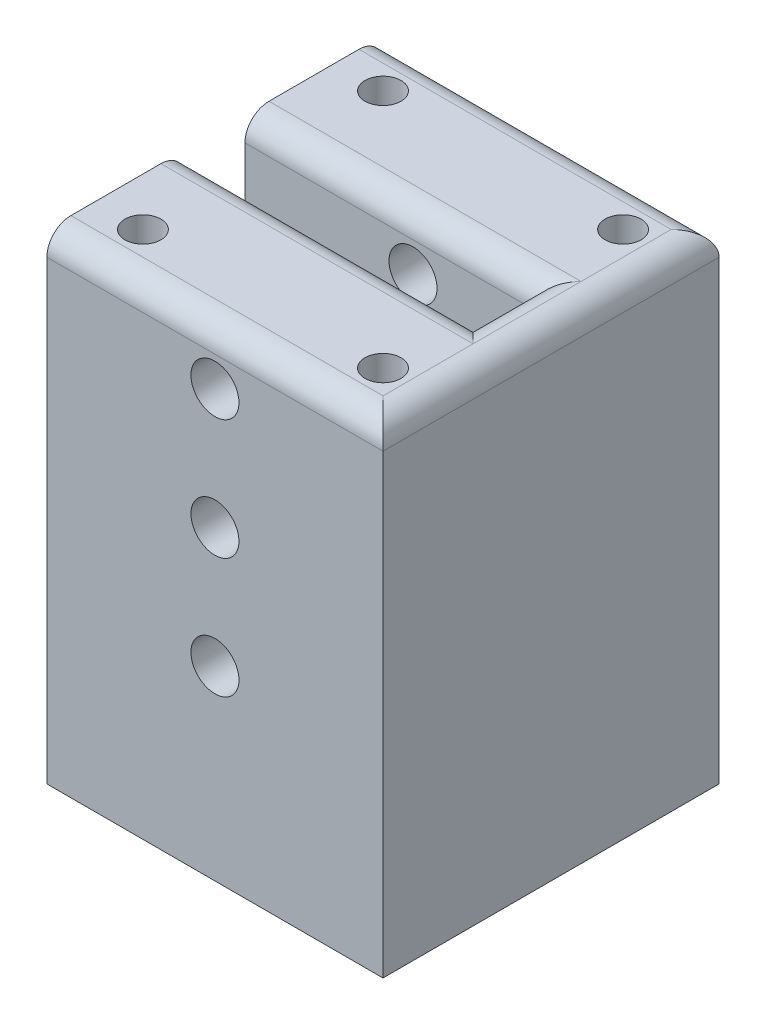
ISO-10303-21;
HEADER;
FILE_DESCRIPTION(('STEP AP214'),'2;1');
FILE_NAME('part.step','',(''),(''),'','','');
FILE_SCHEMA(('AUTOMOTIVE_DESIGN { 1 0 10303 214 1 1 1 1 }'));
ENDSEC;
DATA;
#1=APPLICATION_CONTEXT('core data for automotive mechanical design processes');
#2=APPLICATION_PROTOCOL_DEFINITION('international standard','automotive_design',2000,#1);
#3=PRODUCT_CONTEXT('',#1,'mechanical');
#4=PRODUCT('Part','Part','',(#3));
#5=PRODUCT_RELATED_PRODUCT_CATEGORY('part','',(#4));
#6=PRODUCT_DEFINITION_FORMATION('','',#4);
#7=PRODUCT_DEFINITION_CONTEXT('part definition',#1,'design');
#8=PRODUCT_DEFINITION('design','',#6,#7);
#9=PRODUCT_DEFINITION_SHAPE('','',#8);
#10=(LENGTH_UNIT() NAMED_UNIT(*) SI_UNIT(.MILLI.,.METRE.));
#11=(NAMED_UNIT(*) PLANE_ANGLE_UNIT() SI_UNIT($,.RADIAN.));
#12=(NAMED_UNIT(*) SI_UNIT($,.STERADIAN.) SOLID_ANGLE_UNIT());
#13=UNCERTAINTY_MEASURE_WITH_UNIT(LENGTH_MEASURE(1.E-05),#10,'distance_accuracy_value','');
#14=(GEOMETRIC_REPRESENTATION_CONTEXT(3) GLOBAL_UNCERTAINTY_ASSIGNED_CONTEXT((#13)) GLOBAL_UNIT_ASSIGNED_CONTEXT((#10,
#11,#12)) REPRESENTATION_CONTEXT('',''));
#15=CARTESIAN_POINT('',(0.,0.,0.));
#16=DIRECTION('',(0.,0.,1.));
#17=DIRECTION('',(1.,0.,0.));
#18=AXIS2_PLACEMENT_3D('',#15,#16,#17);
#19=CARTESIAN_POINT('',(0.,40.,0.));
#20=DIRECTION('',(0.,1.,0.));
#21=DIRECTION('',(0.,0.,1.));
#22=AXIS2_PLACEMENT_3D('',#19,#20,#21);
#23=PLANE('',#22);
#24=DIRECTION('',(0.,0.,1.));
#25=VECTOR('',#24,1.);
#26=CARTESIAN_POINT('',(-24.2432407118146,40.,-13.9976530264726));
#27=LINE('',#26,#25);
#28=CARTESIAN_POINT('',(-24.2432407118146,40.,-11.9976530264726));
#29=VERTEX_POINT('',#28);
#30=CARTESIAN_POINT('',(-24.2432407118146,40.,-4.49765302647256));
#31=VERTEX_POINT('',#30);
#32=EDGE_CURVE('E182',#29,#31,#27,.T.);
#33=ORIENTED_EDGE('',*,*,#32,.T.);
#34=DIRECTION('',(-1.,0.,0.));
#35=VECTOR('',#34,1.);
#36=CARTESIAN_POINT('',(-0.243240711814627,40.,-4.49765302647257));
#37=LINE('',#36,#35);
#38=CARTESIAN_POINT('',(1.75675928818537,40.,-4.49765302647256));
#39=VERTEX_POINT('',#38);
#40=EDGE_CURVE('E230',#31,#39,#37,.F.);
#41=ORIENTED_EDGE('',*,*,#40,.T.);
#42=DIRECTION('',(0.,0.,-1.));
#43=VECTOR('',#42,1.);
#44=CARTESIAN_POINT('',(1.75675928818537,40.,-13.9976530264726));
#45=LINE('',#44,#43);
#46=CARTESIAN_POINT('',(1.75675928818537,40.,-11.9976530264726));
#47=VERTEX_POINT('',#46);
#48=EDGE_CURVE('E226',#39,#47,#45,.T.);
#49=ORIENTED_EDGE('',*,*,#48,.T.);
#50=DIRECTION('',(-1.,0.,0.));
#51=VECTOR('',#50,1.);
#52=CARTESIAN_POINT('',(-24.2432407118146,40.,-11.9976530264726));
#53=LINE('',#52,#51);
#54=EDGE_CURVE('E228',#47,#29,#53,.T.);
#55=ORIENTED_EDGE('',*,*,#54,.T.);
#56=EDGE_LOOP('',(#33,#41,#49,#55));
#57=FACE_BOUND('',#56,.T.);
#58=CARTESIAN_POINT('',(-0.243240711814631,40.,-9.99765302647257));
#59=DIRECTION('',(0.,1.,0.));
#60=DIRECTION('',(0.,0.,1.));
#61=AXIS2_PLACEMENT_3D('',#58,#59,#60);
#62=CIRCLE('',#61,1.5);
#63=CARTESIAN_POINT('',(-0.243240711814631,40.,-8.49765302647257));
#64=VERTEX_POINT('',#63);
#65=EDGE_CURVE('E170',#64,#64,#62,.T.);
#66=ORIENTED_EDGE('',*,*,#65,.F.);
#67=EDGE_LOOP('',(#66));
#68=FACE_BOUND('',#67,.T.);
#69=CARTESIAN_POINT('',(-20.2432407118146,40.,-9.99765302647257));
#70=DIRECTION('',(0.,1.,0.));
#71=DIRECTION('',(0.,0.,1.));
#72=AXIS2_PLACEMENT_3D('',#69,#70,#71);
#73=CIRCLE('',#72,1.5);
#74=CARTESIAN_POINT('',(-20.2432407118146,40.,-8.49765302647256));
#75=VERTEX_POINT('',#74);
#76=EDGE_CURVE('E176',#75,#75,#73,.T.);
#77=ORIENTED_EDGE('',*,*,#76,.F.);
#78=EDGE_LOOP('',(#77));
#79=FACE_BOUND('',#78,.T.);
#80=ADVANCED_FACE('F33',(#57,#68,#79),#23,.T.);
#81=DIRECTION('',(0.,0.,-1.));
#82=VECTOR('',#81,1.);
#83=CARTESIAN_POINT('',(1.75675928818537,40.,-13.9976530264726));
#84=LINE('',#83,#82);
#85=CARTESIAN_POINT('',(1.75675928818537,40.,12.0023469735274));
#86=VERTEX_POINT('',#85);
#87=CARTESIAN_POINT('',(1.75675928818537,40.,4.50234697352743));
#88=VERTEX_POINT('',#87);
#89=EDGE_CURVE('E222',#86,#88,#84,.T.);
#90=ORIENTED_EDGE('',*,*,#89,.T.);
#91=DIRECTION('',(1.,0.,0.));
#92=VECTOR('',#91,1.);
#93=CARTESIAN_POINT('',(-24.2432407118146,40.,4.50234697352743));
#94=LINE('',#93,#92);
#95=CARTESIAN_POINT('',(-24.2432407118146,40.,4.50234697352743));
#96=VERTEX_POINT('',#95);
#97=EDGE_CURVE('E224',#88,#96,#94,.F.);
#98=ORIENTED_EDGE('',*,*,#97,.T.);
#99=CARTESIAN_POINT('',(-24.2432407118146,40.,12.0023469735274));
#100=VERTEX_POINT('',#99);
#101=EDGE_CURVE('E186',#96,#100,#27,.T.);
#102=ORIENTED_EDGE('',*,*,#101,.T.);
#103=DIRECTION('',(1.,0.,0.));
#104=VECTOR('',#103,1.);
#105=CARTESIAN_POINT('',(3.75675928818537,40.,12.0023469735274));
#106=LINE('',#105,#104);
#107=EDGE_CURVE('E220',#100,#86,#106,.T.);
#108=ORIENTED_EDGE('',*,*,#107,.T.);
#109=EDGE_LOOP('',(#90,#98,#102,#108));
#110=FACE_BOUND('',#109,.T.);
#111=CARTESIAN_POINT('',(-20.2432407118146,40.,10.0023469735274));
#112=DIRECTION('',(0.,1.,0.));
#113=DIRECTION('',(0.,0.,1.));
#114=AXIS2_PLACEMENT_3D('',#111,#112,#113);
#115=CIRCLE('',#114,1.5);
#116=CARTESIAN_POINT('',(-20.2432407118146,40.,11.5023469735274));
#117=VERTEX_POINT('',#116);
#118=EDGE_CURVE('E164',#117,#117,#115,.T.);
#119=ORIENTED_EDGE('',*,*,#118,.F.);
#120=EDGE_LOOP('',(#119));
#121=FACE_BOUND('',#120,.T.);
#122=CARTESIAN_POINT('',(-0.243240711814628,40.,10.0023469735274));
#123=DIRECTION('',(0.,1.,0.));
#124=DIRECTION('',(0.,0.,1.));
#125=AXIS2_PLACEMENT_3D('',#122,#123,#124);
#126=CIRCLE('',#125,1.5);
#127=CARTESIAN_POINT('',(-0.243240711814628,40.,11.5023469735274));
#128=VERTEX_POINT('',#127);
#129=EDGE_CURVE('E156',#128,#128,#126,.T.);
#130=ORIENTED_EDGE('',*,*,#129,.F.);
#131=EDGE_LOOP('',(#130));
#132=FACE_BOUND('',#131,.T.);
#133=ADVANCED_FACE('F326',(#110,#121,#132),#23,.T.);
#134=CARTESIAN_POINT('',(0.,0.,0.));
#135=DIRECTION('',(0.,1.,0.));
#136=DIRECTION('',(0.,0.,1.));
#137=AXIS2_PLACEMENT_3D('',#134,#135,#136);
#138=PLANE('',#137);
#139=DIRECTION('',(0.,0.,1.));
#140=VECTOR('',#139,1.);
#141=CARTESIAN_POINT('',(-24.2432407118146,0.,-13.9976530264726));
#142=LINE('',#141,#140);
#143=CARTESIAN_POINT('',(-24.2432407118146,0.,-13.9976530264726));
#144=VERTEX_POINT('',#143);
#145=CARTESIAN_POINT('',(-24.2432407118146,0.,14.0023469735274));
#146=VERTEX_POINT('',#145);
#147=EDGE_CURVE('E179',#144,#146,#142,.T.);
#148=ORIENTED_EDGE('',*,*,#147,.F.);
#149=DIRECTION('',(-1.,0.,0.));
#150=VECTOR('',#149,1.);
#151=CARTESIAN_POINT('',(-24.2432407118146,0.,-13.9976530264726));
#152=LINE('',#151,#150);
#153=CARTESIAN_POINT('',(3.75675928818537,0.,-13.9976530264726));
#154=VERTEX_POINT('',#153);
#155=EDGE_CURVE('E195',#154,#144,#152,.T.);
#156=ORIENTED_EDGE('',*,*,#155,.F.);
#157=DIRECTION('',(0.,0.,-1.));
#158=VECTOR('',#157,1.);
#159=CARTESIAN_POINT('',(3.75675928818537,0.,-13.9976530264726));
#160=LINE('',#159,#158);
#161=CARTESIAN_POINT('',(3.75675928818537,0.,14.0023469735274));
#162=VERTEX_POINT('',#161);
#163=EDGE_CURVE('E192',#162,#154,#160,.T.);
#164=ORIENTED_EDGE('',*,*,#163,.F.);
#165=DIRECTION('',(1.,0.,0.));
#166=VECTOR('',#165,1.);
#167=CARTESIAN_POINT('',(-24.2432407118146,0.,14.0023469735274));
#168=LINE('',#167,#166);
#169=EDGE_CURVE('E189',#146,#162,#168,.T.);
#170=ORIENTED_EDGE('',*,*,#169,.F.);
#171=EDGE_LOOP('',(#148,#156,#164,#170));
#172=FACE_BOUND('',#171,.T.);
#173=CARTESIAN_POINT('',(-20.2432407118146,0.,-9.99765302647257));
#174=DIRECTION('',(0.,1.,0.));
#175=DIRECTION('',(0.,0.,1.));
#176=AXIS2_PLACEMENT_3D('',#173,#174,#175);
#177=CIRCLE('',#176,1.5);
#178=CARTESIAN_POINT('',(-20.2432407118146,0.,-8.49765302647256));
#179=VERTEX_POINT('',#178);
#180=EDGE_CURVE('E173',#179,#179,#177,.T.);
#181=ORIENTED_EDGE('',*,*,#180,.T.);
#182=EDGE_LOOP('',(#181));
#183=FACE_BOUND('',#182,.T.);
#184=CARTESIAN_POINT('',(-0.243240711814631,0.,-9.99765302647257));
#185=DIRECTION('',(0.,1.,0.));
#186=DIRECTION('',(0.,0.,1.));
#187=AXIS2_PLACEMENT_3D('',#184,#185,#186);
#188=CIRCLE('',#187,1.5);
#189=CARTESIAN_POINT('',(-0.243240711814631,0.,-8.49765302647257));
#190=VERTEX_POINT('',#189);
#191=EDGE_CURVE('E167',#190,#190,#188,.T.);
#192=ORIENTED_EDGE('',*,*,#191,.T.);
#193=EDGE_LOOP('',(#192));
#194=FACE_BOUND('',#193,.T.);
#195=CARTESIAN_POINT('',(-20.2432407118146,0.,10.0023469735274));
#196=DIRECTION('',(0.,1.,0.));
#197=DIRECTION('',(0.,0.,1.));
#198=AXIS2_PLACEMENT_3D('',#195,#196,#197);
#199=CIRCLE('',#198,1.5);
#200=CARTESIAN_POINT('',(-20.2432407118146,0.,11.5023469735274));
#201=VERTEX_POINT('',#200);
#202=EDGE_CURVE('E159',#201,#201,#199,.T.);
#203=ORIENTED_EDGE('',*,*,#202,.T.);
#204=EDGE_LOOP('',(#203));
#205=FACE_BOUND('',#204,.T.);
#206=CARTESIAN_POINT('',(-0.243240711814628,0.,10.0023469735274));
#207=DIRECTION('',(0.,1.,0.));
#208=DIRECTION('',(0.,0.,1.));
#209=AXIS2_PLACEMENT_3D('',#206,#207,#208);
#210=CIRCLE('',#209,1.5);
#211=CARTESIAN_POINT('',(-0.243240711814628,0.,11.5023469735274));
#212=VERTEX_POINT('',#211);
#213=EDGE_CURVE('E160',#212,#212,#210,.T.);
#214=ORIENTED_EDGE('',*,*,#213,.T.);
#215=EDGE_LOOP('',(#214));
#216=FACE_BOUND('',#215,.T.);
#217=ADVANCED_FACE('F315',(#172,#183,#194,#205,#216),#138,.F.);
#218=CARTESIAN_POINT('',(-24.2432407118146,40.,-13.9976530264726));
#219=DIRECTION('',(1.,0.,0.));
#220=DIRECTION('',(0.,0.,-1.));
#221=AXIS2_PLACEMENT_3D('',#218,#219,#220);
#222=PLANE('',#221);
#223=ORIENTED_EDGE('',*,*,#101,.F.);
#224=CARTESIAN_POINT('',(-24.2432407118146,38.,4.50234697352743));
#225=DIRECTION('',(1.,0.,0.));
#226=DIRECTION('',(0.,0.,-1.));
#227=AXIS2_PLACEMENT_3D('',#224,#225,#226);
#228=CIRCLE('',#227,2.);
#229=CARTESIAN_POINT('',(-24.2432407118146,38.,2.50234697352743));
#230=VERTEX_POINT('',#229);
#231=EDGE_CURVE('E149',#96,#230,#228,.F.);
#232=ORIENTED_EDGE('',*,*,#231,.T.);
#233=DIRECTION('',(0.,1.,0.));
#234=VECTOR('',#233,1.);
#235=CARTESIAN_POINT('',(-24.2432407118146,10.,2.50234697352743));
#236=LINE('',#235,#234);
#237=CARTESIAN_POINT('',(-24.2432407118146,10.,2.50234697352743));
#238=VERTEX_POINT('',#237);
#239=EDGE_CURVE('E127',#238,#230,#236,.T.);
#240=ORIENTED_EDGE('',*,*,#239,.F.);
#241=DIRECTION('',(0.,0.,1.));
#242=VECTOR('',#241,1.);
#243=CARTESIAN_POINT('',(-24.2432407118146,10.,-2.49765302647257));
#244=LINE('',#243,#242);
#245=CARTESIAN_POINT('',(-24.2432407118146,10.,-2.49765302647257));
#246=VERTEX_POINT('',#245);
#247=EDGE_CURVE('E135',#246,#238,#244,.T.);
#248=ORIENTED_EDGE('',*,*,#247,.F.);
#249=DIRECTION('',(0.,1.,0.));
#250=VECTOR('',#249,1.);
#251=CARTESIAN_POINT('',(-24.2432407118146,10.,-2.49765302647257));
#252=LINE('',#251,#250);
#253=CARTESIAN_POINT('',(-24.2432407118146,38.,-2.49765302647257));
#254=VERTEX_POINT('',#253);
#255=EDGE_CURVE('E163',#246,#254,#252,.T.);
#256=ORIENTED_EDGE('',*,*,#255,.T.);
#257=CARTESIAN_POINT('',(-24.2432407118146,38.,-4.49765302647257));
#258=DIRECTION('',(1.,0.,0.));
#259=DIRECTION('',(0.,0.,-1.));
#260=AXIS2_PLACEMENT_3D('',#257,#258,#259);
#261=CIRCLE('',#260,2.);
#262=EDGE_CURVE('E236',#254,#31,#261,.F.);
#263=ORIENTED_EDGE('',*,*,#262,.T.);
#264=ORIENTED_EDGE('',*,*,#32,.F.);
#265=CARTESIAN_POINT('',(-24.2432407118146,38.,-11.9976530264726));
#266=DIRECTION('',(1.,0.,0.));
#267=DIRECTION('',(0.,0.,-1.));
#268=AXIS2_PLACEMENT_3D('',#265,#266,#267);
#269=CIRCLE('',#268,2.);
#270=CARTESIAN_POINT('',(-24.2432407118146,38.,-13.9976530264726));
#271=VERTEX_POINT('',#270);
#272=EDGE_CURVE('E234',#29,#271,#269,.F.);
#273=ORIENTED_EDGE('',*,*,#272,.T.);
#274=DIRECTION('',(0.,-1.,0.));
#275=VECTOR('',#274,1.);
#276=CARTESIAN_POINT('',(-24.2432407118146,40.,-13.9976530264726));
#277=LINE('',#276,#275);
#278=EDGE_CURVE('E185',#271,#144,#277,.T.);
#279=ORIENTED_EDGE('',*,*,#278,.T.);
#280=ORIENTED_EDGE('',*,*,#147,.T.);
#281=DIRECTION('',(0.,-1.,0.));
#282=VECTOR('',#281,1.);
#283=CARTESIAN_POINT('',(-24.2432407118146,40.,14.0023469735274));
#284=LINE('',#283,#282);
#285=CARTESIAN_POINT('',(-24.2432407118146,38.,14.0023469735274));
#286=VERTEX_POINT('',#285);
#287=EDGE_CURVE('E203',#286,#146,#284,.T.);
#288=ORIENTED_EDGE('',*,*,#287,.F.);
#289=CARTESIAN_POINT('',(-24.2432407118146,38.,12.0023469735274));
#290=DIRECTION('',(1.,0.,0.));
#291=DIRECTION('',(0.,0.,-1.));
#292=AXIS2_PLACEMENT_3D('',#289,#290,#291);
#293=CIRCLE('',#292,2.);
#294=EDGE_CURVE('E232',#286,#100,#293,.F.);
#295=ORIENTED_EDGE('',*,*,#294,.T.);
#296=EDGE_LOOP('',(#223,#232,#240,#248,#256,#263,#264,#273,#279,#280,#288,#295));
#297=FACE_BOUND('',#296,.T.);
#298=ADVANCED_FACE('F147',(#297),#222,.F.);
#299=CARTESIAN_POINT('',(-24.2432407118146,40.,14.0023469735274));
#300=DIRECTION('',(0.,0.,-1.));
#301=DIRECTION('',(-1.,0.,0.));
#302=AXIS2_PLACEMENT_3D('',#299,#300,#301);
#303=PLANE('',#302);
#304=CARTESIAN_POINT('',(-10.2432407118146,35.5,14.0023469735274));
#305=DIRECTION('',(0.,0.,1.));
#306=DIRECTION('',(1.,0.,0.));
#307=AXIS2_PLACEMENT_3D('',#304,#305,#306);
#308=CIRCLE('',#307,1.99999999999999);
#309=CARTESIAN_POINT('',(-8.24324071181463,35.5,14.0023469735274));
#310=VERTEX_POINT('',#309);
#311=EDGE_CURVE('E256',#310,#310,#308,.T.);
#312=ORIENTED_EDGE('',*,*,#311,.F.);
#313=EDGE_LOOP('',(#312));
#314=FACE_BOUND('',#313,.T.);
#315=CARTESIAN_POINT('',(-10.2432407118146,25.5,14.0023469735274));
#316=DIRECTION('',(0.,0.,1.));
#317=DIRECTION('',(1.,0.,0.));
#318=AXIS2_PLACEMENT_3D('',#315,#316,#317);
#319=CIRCLE('',#318,1.99999999999999);
#320=CARTESIAN_POINT('',(-8.24324071181463,25.5,14.0023469735274));
#321=VERTEX_POINT('',#320);
#322=EDGE_CURVE('E268',#321,#321,#319,.T.);
#323=ORIENTED_EDGE('',*,*,#322,.F.);
#324=EDGE_LOOP('',(#323));
#325=FACE_BOUND('',#324,.T.);
#326=CARTESIAN_POINT('',(-10.2432407118146,15.5,14.0023469735274));
#327=DIRECTION('',(0.,0.,1.));
#328=DIRECTION('',(1.,0.,0.));
#329=AXIS2_PLACEMENT_3D('',#326,#327,#328);
#330=CIRCLE('',#329,1.99999999999999);
#331=CARTESIAN_POINT('',(-8.24324071181463,15.5,14.0023469735274));
#332=VERTEX_POINT('',#331);
#333=EDGE_CURVE('E275',#332,#332,#330,.T.);
#334=ORIENTED_EDGE('',*,*,#333,.F.);
#335=EDGE_LOOP('',(#334));
#336=FACE_BOUND('',#335,.T.);
#337=DIRECTION('',(0.,-1.,0.));
#338=VECTOR('',#337,1.);
#339=CARTESIAN_POINT('',(3.75675928818537,40.,14.0023469735274));
#340=LINE('',#339,#338);
#341=CARTESIAN_POINT('',(3.75675928818537,38.,14.0023469735274));
#342=VERTEX_POINT('',#341);
#343=EDGE_CURVE('E201',#342,#162,#340,.T.);
#344=ORIENTED_EDGE('',*,*,#343,.F.);
#345=DIRECTION('',(1.,0.,0.));
#346=VECTOR('',#345,1.);
#347=CARTESIAN_POINT('',(-24.2432407118146,38.,14.0023469735274));
#348=LINE('',#347,#346);
#349=EDGE_CURVE('E11',#342,#286,#348,.F.);
#350=ORIENTED_EDGE('',*,*,#349,.T.);
#351=ORIENTED_EDGE('',*,*,#287,.T.);
#352=ORIENTED_EDGE('',*,*,#169,.T.);
#353=EDGE_LOOP('',(#344,#350,#351,#352));
#354=FACE_BOUND('',#353,.T.);
#355=ADVANCED_FACE('F356',(#314,#325,#336,#354),#303,.F.);
#356=CARTESIAN_POINT('',(3.75675928818537,40.,-13.9976530264726));
#357=DIRECTION('',(-1.,0.,0.));
#358=DIRECTION('',(0.,0.,1.));
#359=AXIS2_PLACEMENT_3D('',#356,#357,#358);
#360=PLANE('',#359);
#361=DIRECTION('',(0.,-1.,0.));
#362=VECTOR('',#361,1.);
#363=CARTESIAN_POINT('',(3.75675928818537,40.,-13.9976530264726));
#364=LINE('',#363,#362);
#365=CARTESIAN_POINT('',(3.75675928818537,38.,-13.9976530264726));
#366=VERTEX_POINT('',#365);
#367=EDGE_CURVE('E199',#366,#154,#364,.T.);
#368=ORIENTED_EDGE('',*,*,#367,.F.);
#369=DIRECTION('',(0.,0.,-1.));
#370=VECTOR('',#369,1.);
#371=CARTESIAN_POINT('',(3.75675928818537,38.,14.0023469735274));
#372=LINE('',#371,#370);
#373=EDGE_CURVE('E42',#366,#342,#372,.F.);
#374=ORIENTED_EDGE('',*,*,#373,.T.);
#375=ORIENTED_EDGE('',*,*,#343,.T.);
#376=ORIENTED_EDGE('',*,*,#163,.T.);
#377=EDGE_LOOP('',(#368,#374,#375,#376));
#378=FACE_BOUND('',#377,.T.);
#379=ADVANCED_FACE('F352',(#378),#360,.F.);
#380=CARTESIAN_POINT('',(-24.2432407118146,40.,-13.9976530264726));
#381=DIRECTION('',(0.,0.,1.));
#382=DIRECTION('',(1.,0.,0.));
#383=AXIS2_PLACEMENT_3D('',#380,#381,#382);
#384=PLANE('',#383);
#385=CARTESIAN_POINT('',(-10.2432407118146,35.5,-13.9976530264726));
#386=DIRECTION('',(0.,0.,1.));
#387=DIRECTION('',(1.,0.,0.));
#388=AXIS2_PLACEMENT_3D('',#385,#386,#387);
#389=CIRCLE('',#388,1.99999999999999);
#390=CARTESIAN_POINT('',(-8.24324071181463,35.5,-13.9976530264726));
#391=VERTEX_POINT('',#390);
#392=EDGE_CURVE('E215',#391,#391,#389,.T.);
#393=ORIENTED_EDGE('',*,*,#392,.T.);
#394=EDGE_LOOP('',(#393));
#395=FACE_BOUND('',#394,.T.);
#396=CARTESIAN_POINT('',(-10.2432407118146,25.5,-13.9976530264726));
#397=DIRECTION('',(0.,0.,1.));
#398=DIRECTION('',(1.,0.,0.));
#399=AXIS2_PLACEMENT_3D('',#396,#397,#398);
#400=CIRCLE('',#399,1.99999999999999);
#401=CARTESIAN_POINT('',(-8.24324071181463,25.5,-13.9976530264726));
#402=VERTEX_POINT('',#401);
#403=EDGE_CURVE('E210',#402,#402,#400,.T.);
#404=ORIENTED_EDGE('',*,*,#403,.T.);
#405=EDGE_LOOP('',(#404));
#406=FACE_BOUND('',#405,.T.);
#407=CARTESIAN_POINT('',(-10.2432407118146,15.5,-13.9976530264726));
#408=DIRECTION('',(0.,0.,1.));
#409=DIRECTION('',(1.,0.,0.));
#410=AXIS2_PLACEMENT_3D('',#407,#408,#409);
#411=CIRCLE('',#410,1.99999999999999);
#412=CARTESIAN_POINT('',(-8.24324071181463,15.5,-13.9976530264726));
#413=VERTEX_POINT('',#412);
#414=EDGE_CURVE('E278',#413,#413,#411,.T.);
#415=ORIENTED_EDGE('',*,*,#414,.T.);
#416=EDGE_LOOP('',(#415));
#417=FACE_BOUND('',#416,.T.);
#418=ORIENTED_EDGE('',*,*,#278,.F.);
#419=DIRECTION('',(-1.,0.,0.));
#420=VECTOR('',#419,1.);
#421=CARTESIAN_POINT('',(3.75675928818537,38.,-13.9976530264726));
#422=LINE('',#421,#420);
#423=EDGE_CURVE('E57',#271,#366,#422,.F.);
#424=ORIENTED_EDGE('',*,*,#423,.T.);
#425=ORIENTED_EDGE('',*,*,#367,.T.);
#426=ORIENTED_EDGE('',*,*,#155,.T.);
#427=EDGE_LOOP('',(#418,#424,#425,#426));
#428=FACE_BOUND('',#427,.T.);
#429=ADVANCED_FACE('F309',(#395,#406,#417,#428),#384,.F.);
#430=CARTESIAN_POINT('',(-20.2432407118146,40.,-9.99765302647257));
#431=DIRECTION('',(0.,-1.,0.));
#432=DIRECTION('',(0.,0.,-1.));
#433=AXIS2_PLACEMENT_3D('',#430,#431,#432);
#434=CYLINDRICAL_SURFACE('',#433,1.5);
#435=ORIENTED_EDGE('',*,*,#76,.T.);
#436=EDGE_LOOP('',(#435));
#437=FACE_BOUND('',#436,.T.);
#438=ORIENTED_EDGE('',*,*,#180,.F.);
#439=EDGE_LOOP('',(#438));
#440=FACE_BOUND('',#439,.T.);
#441=ADVANCED_FACE('F346',(#437,#440),#434,.F.);
#442=CARTESIAN_POINT('',(-0.243240711814631,40.,-9.99765302647257));
#443=DIRECTION('',(0.,-1.,0.));
#444=DIRECTION('',(0.,0.,-1.));
#445=AXIS2_PLACEMENT_3D('',#442,#443,#444);
#446=CYLINDRICAL_SURFACE('',#445,1.5);
#447=ORIENTED_EDGE('',*,*,#65,.T.);
#448=EDGE_LOOP('',(#447));
#449=FACE_BOUND('',#448,.T.);
#450=ORIENTED_EDGE('',*,*,#191,.F.);
#451=EDGE_LOOP('',(#450));
#452=FACE_BOUND('',#451,.T.);
#453=ADVANCED_FACE('F500',(#449,#452),#446,.F.);
#454=CARTESIAN_POINT('',(-20.2432407118146,40.,10.0023469735274));
#455=DIRECTION('',(0.,-1.,0.));
#456=DIRECTION('',(0.,0.,-1.));
#457=AXIS2_PLACEMENT_3D('',#454,#455,#456);
#458=CYLINDRICAL_SURFACE('',#457,1.5);
#459=ORIENTED_EDGE('',*,*,#118,.T.);
#460=EDGE_LOOP('',(#459));
#461=FACE_BOUND('',#460,.T.);
#462=ORIENTED_EDGE('',*,*,#202,.F.);
#463=EDGE_LOOP('',(#462));
#464=FACE_BOUND('',#463,.T.);
#465=ADVANCED_FACE('F491',(#461,#464),#458,.F.);
#466=CARTESIAN_POINT('',(-0.243240711814628,40.,10.0023469735274));
#467=DIRECTION('',(0.,-1.,0.));
#468=DIRECTION('',(0.,0.,-1.));
#469=AXIS2_PLACEMENT_3D('',#466,#467,#468);
#470=CYLINDRICAL_SURFACE('',#469,1.5);
#471=ORIENTED_EDGE('',*,*,#129,.T.);
#472=EDGE_LOOP('',(#471));
#473=FACE_BOUND('',#472,.T.);
#474=ORIENTED_EDGE('',*,*,#213,.F.);
#475=EDGE_LOOP('',(#474));
#476=FACE_BOUND('',#475,.T.);
#477=ADVANCED_FACE('F482',(#473,#476),#470,.F.);
#478=CARTESIAN_POINT('',(-24.2432407118146,10.,-2.49765302647257));
#479=DIRECTION('',(0.,0.,-1.));
#480=DIRECTION('',(-1.,0.,0.));
#481=AXIS2_PLACEMENT_3D('',#478,#479,#480);
#482=PLANE('',#481);
#483=CARTESIAN_POINT('',(-10.2432407118146,35.5,-2.49765302647257));
#484=DIRECTION('',(0.,0.,-1.));
#485=DIRECTION('',(-1.,0.,0.));
#486=AXIS2_PLACEMENT_3D('',#483,#484,#485);
#487=CIRCLE('',#486,1.99999999999999);
#488=CARTESIAN_POINT('',(-12.2432407118146,35.5,-2.49765302647257));
#489=VERTEX_POINT('',#488);
#490=EDGE_CURVE('E211',#489,#489,#487,.T.);
#491=ORIENTED_EDGE('',*,*,#490,.T.);
#492=EDGE_LOOP('',(#491));
#493=FACE_BOUND('',#492,.T.);
#494=CARTESIAN_POINT('',(-10.2432407118146,25.5,-2.49765302647257));
#495=DIRECTION('',(0.,0.,-1.));
#496=DIRECTION('',(-1.,0.,0.));
#497=AXIS2_PLACEMENT_3D('',#494,#495,#496);
#498=CIRCLE('',#497,1.99999999999999);
#499=CARTESIAN_POINT('',(-12.2432407118146,25.5,-2.49765302647257));
#500=VERTEX_POINT('',#499);
#501=EDGE_CURVE('E209',#500,#500,#498,.T.);
#502=ORIENTED_EDGE('',*,*,#501,.T.);
#503=EDGE_LOOP('',(#502));
#504=FACE_BOUND('',#503,.T.);
#505=CARTESIAN_POINT('',(-10.2432407118146,15.5,-2.49765302647257));
#506=DIRECTION('',(0.,0.,-1.));
#507=DIRECTION('',(-1.,0.,0.));
#508=AXIS2_PLACEMENT_3D('',#505,#506,#507);
#509=CIRCLE('',#508,1.99999999999999);
#510=CARTESIAN_POINT('',(-12.2432407118146,15.5,-2.49765302647257));
#511=VERTEX_POINT('',#510);
#512=EDGE_CURVE('E144',#511,#511,#509,.T.);
#513=ORIENTED_EDGE('',*,*,#512,.T.);
#514=EDGE_LOOP('',(#513));
#515=FACE_BOUND('',#514,.T.);
#516=DIRECTION('',(0.,1.,0.));
#517=VECTOR('',#516,1.);
#518=CARTESIAN_POINT('',(-0.243240711814627,10.,-2.49765302647257));
#519=LINE('',#518,#517);
#520=CARTESIAN_POINT('',(-0.243240711814627,10.,-2.49765302647257));
#521=VERTEX_POINT('',#520);
#522=CARTESIAN_POINT('',(-0.243240711814627,38.,-2.49765302647257));
#523=VERTEX_POINT('',#522);
#524=EDGE_CURVE('E151',#521,#523,#519,.T.);
#525=ORIENTED_EDGE('',*,*,#524,.T.);
#526=DIRECTION('',(-1.,0.,0.));
#527=VECTOR('',#526,1.);
#528=CARTESIAN_POINT('',(-24.2432407118146,38.,-2.49765302647257));
#529=LINE('',#528,#527);
#530=EDGE_CURVE('E239',#523,#254,#529,.T.);
#531=ORIENTED_EDGE('',*,*,#530,.T.);
#532=ORIENTED_EDGE('',*,*,#255,.F.);
#533=DIRECTION('',(-1.,0.,0.));
#534=VECTOR('',#533,1.);
#535=CARTESIAN_POINT('',(-24.2432407118146,10.,-2.49765302647257));
#536=LINE('',#535,#534);
#537=EDGE_CURVE('E140',#521,#246,#536,.T.);
#538=ORIENTED_EDGE('',*,*,#537,.F.);
#539=EDGE_LOOP('',(#525,#531,#532,#538));
#540=FACE_BOUND('',#539,.T.);
#541=ADVANCED_FACE('F289',(#493,#504,#515,#540),#482,.F.);
#542=CARTESIAN_POINT('',(-0.243240711814627,10.,-2.49765302647257));
#543=DIRECTION('',(1.,0.,0.));
#544=DIRECTION('',(0.,0.,-1.));
#545=AXIS2_PLACEMENT_3D('',#542,#543,#544);
#546=PLANE('',#545);
#547=DIRECTION('',(0.,1.,0.));
#548=VECTOR('',#547,1.);
#549=CARTESIAN_POINT('',(-0.243240711814627,10.,2.50234697352743));
#550=LINE('',#549,#548);
#551=CARTESIAN_POINT('',(-0.243240711814627,10.,2.50234697352743));
#552=VERTEX_POINT('',#551);
#553=CARTESIAN_POINT('',(-0.243240711814627,38.,2.50234697352743));
#554=VERTEX_POINT('',#553);
#555=EDGE_CURVE('E130',#552,#554,#550,.T.);
#556=ORIENTED_EDGE('',*,*,#555,.T.);
#557=DIRECTION('',(0.,0.,-1.));
#558=VECTOR('',#557,1.);
#559=CARTESIAN_POINT('',(-0.243240711814627,38.,-2.49765302647257));
#560=LINE('',#559,#558);
#561=EDGE_CURVE('E205',#554,#523,#560,.T.);
#562=ORIENTED_EDGE('',*,*,#561,.T.);
#563=ORIENTED_EDGE('',*,*,#524,.F.);
#564=DIRECTION('',(0.,0.,-1.));
#565=VECTOR('',#564,1.);
#566=CARTESIAN_POINT('',(-0.243240711814627,10.,-2.49765302647257));
#567=LINE('',#566,#565);
#568=EDGE_CURVE('E134',#552,#521,#567,.T.);
#569=ORIENTED_EDGE('',*,*,#568,.F.);
#570=EDGE_LOOP('',(#556,#562,#563,#569));
#571=FACE_BOUND('',#570,.T.);
#572=ADVANCED_FACE('F292',(#571),#546,.F.);
#573=CARTESIAN_POINT('',(-24.2432407118146,10.,2.50234697352743));
#574=DIRECTION('',(0.,0.,1.));
#575=DIRECTION('',(1.,0.,0.));
#576=AXIS2_PLACEMENT_3D('',#573,#574,#575);
#577=PLANE('',#576);
#578=CARTESIAN_POINT('',(-10.2432407118146,35.5,2.50234697352743));
#579=DIRECTION('',(0.,0.,1.));
#580=DIRECTION('',(1.,0.,0.));
#581=AXIS2_PLACEMENT_3D('',#578,#579,#580);
#582=CIRCLE('',#581,1.99999999999999);
#583=CARTESIAN_POINT('',(-8.24324071181463,35.5,2.50234697352743));
#584=VERTEX_POINT('',#583);
#585=EDGE_CURVE('E214',#584,#584,#582,.T.);
#586=ORIENTED_EDGE('',*,*,#585,.T.);
#587=EDGE_LOOP('',(#586));
#588=FACE_BOUND('',#587,.T.);
#589=CARTESIAN_POINT('',(-10.2432407118146,25.5,2.50234697352743));
#590=DIRECTION('',(0.,0.,1.));
#591=DIRECTION('',(1.,0.,0.));
#592=AXIS2_PLACEMENT_3D('',#589,#590,#591);
#593=CIRCLE('',#592,1.99999999999999);
#594=CARTESIAN_POINT('',(-8.24324071181463,25.5,2.50234697352743));
#595=VERTEX_POINT('',#594);
#596=EDGE_CURVE('E206',#595,#595,#593,.T.);
#597=ORIENTED_EDGE('',*,*,#596,.T.);
#598=EDGE_LOOP('',(#597));
#599=FACE_BOUND('',#598,.T.);
#600=CARTESIAN_POINT('',(-10.2432407118146,15.5,2.50234697352743));
#601=DIRECTION('',(0.,0.,1.));
#602=DIRECTION('',(1.,0.,0.));
#603=AXIS2_PLACEMENT_3D('',#600,#601,#602);
#604=CIRCLE('',#603,1.99999999999999);
#605=CARTESIAN_POINT('',(-8.24324071181463,15.5,2.50234697352743));
#606=VERTEX_POINT('',#605);
#607=EDGE_CURVE('E281',#606,#606,#604,.T.);
#608=ORIENTED_EDGE('',*,*,#607,.T.);
#609=EDGE_LOOP('',(#608));
#610=FACE_BOUND('',#609,.T.);
#611=ORIENTED_EDGE('',*,*,#239,.T.);
#612=DIRECTION('',(1.,0.,0.));
#613=VECTOR('',#612,1.);
#614=CARTESIAN_POINT('',(-0.243240711814627,38.,2.50234697352743));
#615=LINE('',#614,#613);
#616=EDGE_CURVE('E218',#230,#554,#615,.T.);
#617=ORIENTED_EDGE('',*,*,#616,.T.);
#618=ORIENTED_EDGE('',*,*,#555,.F.);
#619=DIRECTION('',(1.,0.,0.));
#620=VECTOR('',#619,1.);
#621=CARTESIAN_POINT('',(-24.2432407118146,10.,2.50234697352743));
#622=LINE('',#621,#620);
#623=EDGE_CURVE('E123',#238,#552,#622,.T.);
#624=ORIENTED_EDGE('',*,*,#623,.F.);
#625=EDGE_LOOP('',(#611,#617,#618,#624));
#626=FACE_BOUND('',#625,.T.);
#627=ADVANCED_FACE('F125',(#588,#599,#610,#626),#577,.F.);
#628=CARTESIAN_POINT('',(0.,10.,0.));
#629=DIRECTION('',(0.,1.,0.));
#630=DIRECTION('',(0.,0.,1.));
#631=AXIS2_PLACEMENT_3D('',#628,#629,#630);
#632=PLANE('',#631);
#633=ORIENTED_EDGE('',*,*,#247,.T.);
#634=ORIENTED_EDGE('',*,*,#623,.T.);
#635=ORIENTED_EDGE('',*,*,#568,.T.);
#636=ORIENTED_EDGE('',*,*,#537,.T.);
#637=EDGE_LOOP('',(#633,#634,#635,#636));
#638=FACE_BOUND('',#637,.T.);
#639=ADVANCED_FACE('F138',(#638),#632,.T.);
#640=CARTESIAN_POINT('',(-10.2432407118146,15.5,14.0023469735274));
#641=DIRECTION('',(0.,0.,1.));
#642=DIRECTION('',(1.,0.,0.));
#643=AXIS2_PLACEMENT_3D('',#640,#641,#642);
#644=CYLINDRICAL_SURFACE('',#643,1.99999999999999);
#645=ORIENTED_EDGE('',*,*,#333,.T.);
#646=EDGE_LOOP('',(#645));
#647=FACE_BOUND('',#646,.T.);
#648=ORIENTED_EDGE('',*,*,#607,.F.);
#649=EDGE_LOOP('',(#648));
#650=FACE_BOUND('',#649,.T.);
#651=ADVANCED_FACE('F444',(#647,#650),#644,.F.);
#652=ORIENTED_EDGE('',*,*,#414,.F.);
#653=EDGE_LOOP('',(#652));
#654=FACE_BOUND('',#653,.T.);
#655=ORIENTED_EDGE('',*,*,#512,.F.);
#656=EDGE_LOOP('',(#655));
#657=FACE_BOUND('',#656,.T.);
#658=ADVANCED_FACE('F436',(#654,#657),#644,.F.);
#659=CARTESIAN_POINT('',(-10.2432407118146,25.5,14.0023469735274));
#660=DIRECTION('',(0.,0.,1.));
#661=DIRECTION('',(1.,0.,0.));
#662=AXIS2_PLACEMENT_3D('',#659,#660,#661);
#663=CYLINDRICAL_SURFACE('',#662,1.99999999999999);
#664=ORIENTED_EDGE('',*,*,#322,.T.);
#665=EDGE_LOOP('',(#664));
#666=FACE_BOUND('',#665,.T.);
#667=ORIENTED_EDGE('',*,*,#596,.F.);
#668=EDGE_LOOP('',(#667));
#669=FACE_BOUND('',#668,.T.);
#670=ADVANCED_FACE('F427',(#666,#669),#663,.F.);
#671=ORIENTED_EDGE('',*,*,#403,.F.);
#672=EDGE_LOOP('',(#671));
#673=FACE_BOUND('',#672,.T.);
#674=ORIENTED_EDGE('',*,*,#501,.F.);
#675=EDGE_LOOP('',(#674));
#676=FACE_BOUND('',#675,.T.);
#677=ADVANCED_FACE('F419',(#673,#676),#663,.F.);
#678=CARTESIAN_POINT('',(-10.2432407118146,35.5,14.0023469735274));
#679=DIRECTION('',(0.,0.,1.));
#680=DIRECTION('',(1.,0.,0.));
#681=AXIS2_PLACEMENT_3D('',#678,#679,#680);
#682=CYLINDRICAL_SURFACE('',#681,1.99999999999999);
#683=ORIENTED_EDGE('',*,*,#392,.F.);
#684=EDGE_LOOP('',(#683));
#685=FACE_BOUND('',#684,.T.);
#686=ORIENTED_EDGE('',*,*,#490,.F.);
#687=EDGE_LOOP('',(#686));
#688=FACE_BOUND('',#687,.T.);
#689=ADVANCED_FACE('F411',(#685,#688),#682,.F.);
#690=ORIENTED_EDGE('',*,*,#311,.T.);
#691=EDGE_LOOP('',(#690));
#692=FACE_BOUND('',#691,.T.);
#693=ORIENTED_EDGE('',*,*,#585,.F.);
#694=EDGE_LOOP('',(#693));
#695=FACE_BOUND('',#694,.T.);
#696=ADVANCED_FACE('F398',(#692,#695),#682,.F.);
#697=CARTESIAN_POINT('',(0.,38.,-11.9976530264726));
#698=DIRECTION('',(1.,0.,0.));
#699=DIRECTION('',(0.,0.,-1.));
#700=AXIS2_PLACEMENT_3D('',#697,#698,#699);
#701=CYLINDRICAL_SURFACE('',#700,2.);
#702=ORIENTED_EDGE('',*,*,#272,.F.);
#703=ORIENTED_EDGE('',*,*,#54,.F.);
#704=CARTESIAN_POINT('',(1.75675928818537,38.,-11.9976530264726));
#705=DIRECTION('',(0.707106781186548,0.,0.707106781186547));
#706=DIRECTION('',(-0.707106781186547,0.,0.707106781186548));
#707=AXIS2_PLACEMENT_3D('',#704,#705,#706);
#708=ELLIPSE('',#707,2.82842712474619,2.);
#709=EDGE_CURVE('E37',#366,#47,#708,.T.);
#710=ORIENTED_EDGE('',*,*,#709,.F.);
#711=ORIENTED_EDGE('',*,*,#423,.F.);
#712=EDGE_LOOP('',(#702,#703,#710,#711));
#713=FACE_BOUND('',#712,.T.);
#714=ADVANCED_FACE('F35',(#713),#701,.T.);
#715=CARTESIAN_POINT('',(0.,38.,12.0023469735274));
#716=DIRECTION('',(-1.,0.,0.));
#717=DIRECTION('',(0.,0.,1.));
#718=AXIS2_PLACEMENT_3D('',#715,#716,#717);
#719=CYLINDRICAL_SURFACE('',#718,2.);
#720=ORIENTED_EDGE('',*,*,#294,.F.);
#721=ORIENTED_EDGE('',*,*,#349,.F.);
#722=CARTESIAN_POINT('',(1.75675928818537,38.,12.0023469735274));
#723=DIRECTION('',(-0.707106781186547,0.,0.707106781186548));
#724=DIRECTION('',(-0.707106781186548,0.,-0.707106781186547));
#725=AXIS2_PLACEMENT_3D('',#722,#723,#724);
#726=ELLIPSE('',#725,2.82842712474619,2.);
#727=EDGE_CURVE('E250',#86,#342,#726,.F.);
#728=ORIENTED_EDGE('',*,*,#727,.F.);
#729=ORIENTED_EDGE('',*,*,#107,.F.);
#730=EDGE_LOOP('',(#720,#721,#728,#729));
#731=FACE_BOUND('',#730,.T.);
#732=ADVANCED_FACE('F324',(#731),#719,.T.);
#733=CARTESIAN_POINT('',(1.75675928818537,38.,0.));
#734=DIRECTION('',(0.,0.,1.));
#735=DIRECTION('',(1.,0.,0.));
#736=AXIS2_PLACEMENT_3D('',#733,#734,#735);
#737=CYLINDRICAL_SURFACE('',#736,2.);
#738=ORIENTED_EDGE('',*,*,#709,.T.);
#739=ORIENTED_EDGE('',*,*,#48,.F.);
#740=DIRECTION('',(0.,0.,-1.));
#741=VECTOR('',#740,1.);
#742=CARTESIAN_POINT('',(1.75675928818537,40.,-13.9976530264726));
#743=LINE('',#742,#741);
#744=EDGE_CURVE('E248',#88,#39,#743,.T.);
#745=ORIENTED_EDGE('',*,*,#744,.F.);
#746=ORIENTED_EDGE('',*,*,#89,.F.);
#747=ORIENTED_EDGE('',*,*,#727,.T.);
#748=ORIENTED_EDGE('',*,*,#373,.F.);
#749=EDGE_LOOP('',(#738,#739,#745,#746,#747,#748));
#750=FACE_BOUND('',#749,.T.);
#751=ADVANCED_FACE('F331',(#750),#737,.T.);
#752=CARTESIAN_POINT('',(-24.2432407118146,38.,4.50234697352743));
#753=DIRECTION('',(-1.,0.,0.));
#754=DIRECTION('',(0.,0.,1.));
#755=AXIS2_PLACEMENT_3D('',#752,#753,#754);
#756=CYLINDRICAL_SURFACE('',#755,2.);
#757=ORIENTED_EDGE('',*,*,#231,.F.);
#758=ORIENTED_EDGE('',*,*,#97,.F.);
#759=CARTESIAN_POINT('',(1.75675928818537,38.,4.50234697352743));
#760=DIRECTION('',(-0.707106781186547,0.,0.707106781186547));
#761=DIRECTION('',(0.707106781186547,0.,0.707106781186547));
#762=AXIS2_PLACEMENT_3D('',#759,#760,#761);
#763=ELLIPSE('',#762,2.82842712474619,2.);
#764=EDGE_CURVE('E245',#554,#88,#763,.F.);
#765=ORIENTED_EDGE('',*,*,#764,.F.);
#766=ORIENTED_EDGE('',*,*,#616,.F.);
#767=EDGE_LOOP('',(#757,#758,#765,#766));
#768=FACE_BOUND('',#767,.T.);
#769=ADVANCED_FACE('F330',(#768),#756,.T.);
#770=CARTESIAN_POINT('',(-24.2432407118146,38.,-4.49765302647257));
#771=DIRECTION('',(1.,0.,0.));
#772=DIRECTION('',(0.,0.,-1.));
#773=AXIS2_PLACEMENT_3D('',#770,#771,#772);
#774=CYLINDRICAL_SURFACE('',#773,2.);
#775=ORIENTED_EDGE('',*,*,#262,.F.);
#776=ORIENTED_EDGE('',*,*,#530,.F.);
#777=CARTESIAN_POINT('',(1.75675928818537,38.,-4.49765302647257));
#778=DIRECTION('',(0.707106781186547,0.,0.707106781186547));
#779=DIRECTION('',(-0.707106781186547,0.,0.707106781186547));
#780=AXIS2_PLACEMENT_3D('',#777,#778,#779);
#781=ELLIPSE('',#780,2.82842712474619,2.);
#782=EDGE_CURVE('E243',#39,#523,#781,.T.);
#783=ORIENTED_EDGE('',*,*,#782,.F.);
#784=ORIENTED_EDGE('',*,*,#40,.F.);
#785=EDGE_LOOP('',(#775,#776,#783,#784));
#786=FACE_BOUND('',#785,.T.);
#787=ADVANCED_FACE('F302',(#786),#774,.T.);
#788=CARTESIAN_POINT('',(1.75675928818537,38.,-2.49765302647257));
#789=DIRECTION('',(0.,0.,1.));
#790=DIRECTION('',(1.,0.,0.));
#791=AXIS2_PLACEMENT_3D('',#788,#789,#790);
#792=CYLINDRICAL_SURFACE('',#791,2.);
#793=ORIENTED_EDGE('',*,*,#764,.T.);
#794=ORIENTED_EDGE('',*,*,#744,.T.);
#795=ORIENTED_EDGE('',*,*,#782,.T.);
#796=ORIENTED_EDGE('',*,*,#561,.F.);
#797=EDGE_LOOP('',(#793,#794,#795,#796));
#798=FACE_BOUND('',#797,.T.);
#799=ADVANCED_FACE('F296',(#798),#792,.T.);
#800=CLOSED_SHELL('',(#80,#133,#217,#298,#355,#379,#429,#441,#453,#465,#477,#541,#572,#627,#639,
#651,#658,#670,#677,#689,#696,#714,#732,#751,#769,#787,#799));
#801=MANIFOLD_SOLID_BREP('B2',#800);
#802=ADVANCED_BREP_SHAPE_REPRESENTATION('',(#18,#801),#14);
#803=SHAPE_DEFINITION_REPRESENTATION(#9,#802);
ENDSEC;
END-ISO-10303-21;
